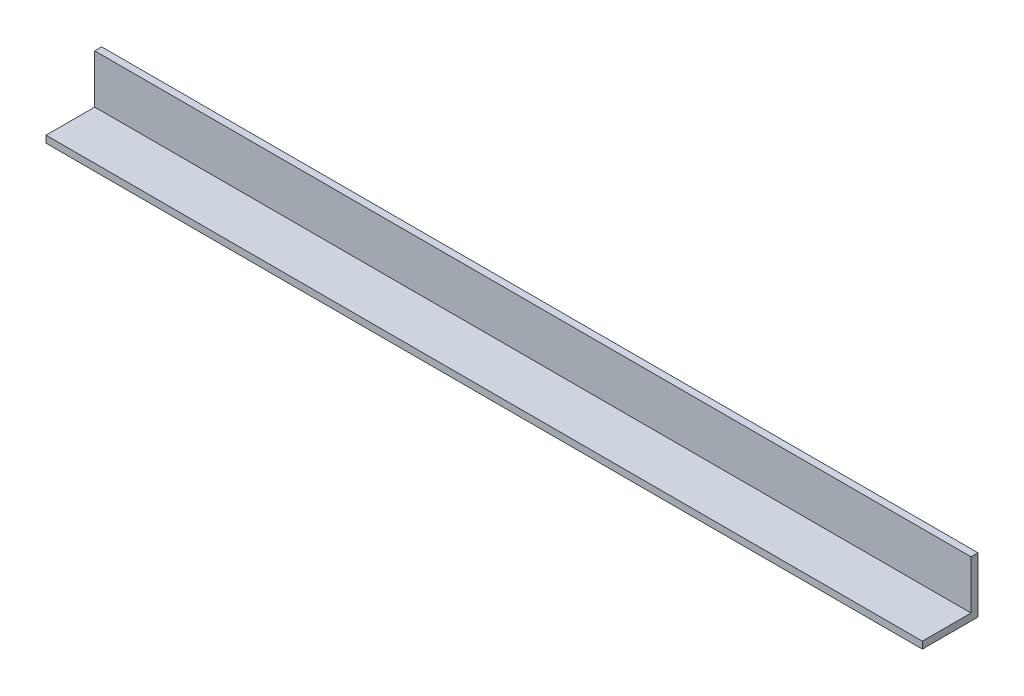
ISO-10303-21;
HEADER;
FILE_DESCRIPTION(('STEP AP214'),'2;1');
FILE_NAME('part.step','',(''),(''),'','','');
FILE_SCHEMA(('AUTOMOTIVE_DESIGN { 1 0 10303 214 1 1 1 1 }'));
ENDSEC;
DATA;
#1=APPLICATION_CONTEXT('core data for automotive mechanical design processes');
#2=APPLICATION_PROTOCOL_DEFINITION('international standard','automotive_design',2000,#1);
#3=PRODUCT_CONTEXT('',#1,'mechanical');
#4=PRODUCT('Part','Part','',(#3));
#5=PRODUCT_RELATED_PRODUCT_CATEGORY('part','',(#4));
#6=PRODUCT_DEFINITION_FORMATION('','',#4);
#7=PRODUCT_DEFINITION_CONTEXT('part definition',#1,'design');
#8=PRODUCT_DEFINITION('design','',#6,#7);
#9=PRODUCT_DEFINITION_SHAPE('','',#8);
#10=(LENGTH_UNIT() NAMED_UNIT(*) SI_UNIT(.MILLI.,.METRE.));
#11=(NAMED_UNIT(*) PLANE_ANGLE_UNIT() SI_UNIT($,.RADIAN.));
#12=(NAMED_UNIT(*) SI_UNIT($,.STERADIAN.) SOLID_ANGLE_UNIT());
#13=UNCERTAINTY_MEASURE_WITH_UNIT(LENGTH_MEASURE(1.E-05),#10,'distance_accuracy_value','');
#14=(GEOMETRIC_REPRESENTATION_CONTEXT(3) GLOBAL_UNCERTAINTY_ASSIGNED_CONTEXT((#13)) GLOBAL_UNIT_ASSIGNED_CONTEXT((#10,
#11,#12)) REPRESENTATION_CONTEXT('',''));
#15=CARTESIAN_POINT('',(0.,0.,0.));
#16=DIRECTION('',(0.,0.,1.));
#17=DIRECTION('',(1.,0.,0.));
#18=AXIS2_PLACEMENT_3D('',#15,#16,#17);
#19=CARTESIAN_POINT('',(400.,25.4,3.175));
#20=DIRECTION('',(0.,-1.,0.));
#21=DIRECTION('',(0.,0.,-1.));
#22=AXIS2_PLACEMENT_3D('',#19,#20,#21);
#23=PLANE('',#22);
#24=DIRECTION('',(0.,0.,1.));
#25=VECTOR('',#24,1.);
#26=CARTESIAN_POINT('',(0.,25.4,3.175));
#27=LINE('',#26,#25);
#28=CARTESIAN_POINT('',(0.,25.4,0.));
#29=VERTEX_POINT('',#28);
#30=CARTESIAN_POINT('',(0.,25.4,3.175));
#31=VERTEX_POINT('',#30);
#32=EDGE_CURVE('E119',#29,#31,#27,.T.);
#33=ORIENTED_EDGE('',*,*,#32,.T.);
#34=DIRECTION('',(-1.,0.,0.));
#35=VECTOR('',#34,1.);
#36=CARTESIAN_POINT('',(400.,25.4,3.175));
#37=LINE('',#36,#35);
#38=CARTESIAN_POINT('',(400.,25.4,3.175));
#39=VERTEX_POINT('',#38);
#40=EDGE_CURVE('E11',#39,#31,#37,.T.);
#41=ORIENTED_EDGE('',*,*,#40,.F.);
#42=DIRECTION('',(0.,0.,1.));
#43=VECTOR('',#42,1.);
#44=CARTESIAN_POINT('',(400.,25.4,3.175));
#45=LINE('',#44,#43);
#46=CARTESIAN_POINT('',(400.,25.4,0.));
#47=VERTEX_POINT('',#46);
#48=EDGE_CURVE('E129',#47,#39,#45,.T.);
#49=ORIENTED_EDGE('',*,*,#48,.F.);
#50=DIRECTION('',(-1.,0.,0.));
#51=VECTOR('',#50,1.);
#52=CARTESIAN_POINT('',(400.,25.4,0.));
#53=LINE('',#52,#51);
#54=EDGE_CURVE('E115',#47,#29,#53,.T.);
#55=ORIENTED_EDGE('',*,*,#54,.T.);
#56=EDGE_LOOP('',(#33,#41,#49,#55));
#57=FACE_BOUND('',#56,.T.);
#58=ADVANCED_FACE('F35',(#57),#23,.F.);
#59=CARTESIAN_POINT('',(400.,3.175,3.175));
#60=DIRECTION('',(0.,0.,-1.));
#61=DIRECTION('',(0.,1.,0.));
#62=AXIS2_PLACEMENT_3D('',#59,#60,#61);
#63=PLANE('',#62);
#64=DIRECTION('',(0.,-1.,0.));
#65=VECTOR('',#64,1.);
#66=CARTESIAN_POINT('',(0.,3.175,3.175));
#67=LINE('',#66,#65);
#68=CARTESIAN_POINT('',(0.,3.175,3.175));
#69=VERTEX_POINT('',#68);
#70=EDGE_CURVE('E122',#31,#69,#67,.T.);
#71=ORIENTED_EDGE('',*,*,#70,.T.);
#72=DIRECTION('',(-1.,0.,0.));
#73=VECTOR('',#72,1.);
#74=CARTESIAN_POINT('',(400.,3.175,3.175));
#75=LINE('',#74,#73);
#76=CARTESIAN_POINT('',(400.,3.175,3.175));
#77=VERTEX_POINT('',#76);
#78=EDGE_CURVE('E43',#77,#69,#75,.T.);
#79=ORIENTED_EDGE('',*,*,#78,.F.);
#80=DIRECTION('',(0.,-1.,0.));
#81=VECTOR('',#80,1.);
#82=CARTESIAN_POINT('',(400.,3.175,3.175));
#83=LINE('',#82,#81);
#84=EDGE_CURVE('E88',#39,#77,#83,.T.);
#85=ORIENTED_EDGE('',*,*,#84,.F.);
#86=ORIENTED_EDGE('',*,*,#40,.T.);
#87=EDGE_LOOP('',(#71,#79,#85,#86));
#88=FACE_BOUND('',#87,.T.);
#89=ADVANCED_FACE('F153',(#88),#63,.F.);
#90=CARTESIAN_POINT('',(400.,3.175,25.4));
#91=DIRECTION('',(0.,-1.,0.));
#92=DIRECTION('',(0.,0.,-1.));
#93=AXIS2_PLACEMENT_3D('',#90,#91,#92);
#94=PLANE('',#93);
#95=DIRECTION('',(0.,0.,1.));
#96=VECTOR('',#95,1.);
#97=CARTESIAN_POINT('',(0.,3.175,25.4));
#98=LINE('',#97,#96);
#99=CARTESIAN_POINT('',(0.,3.175,25.4));
#100=VERTEX_POINT('',#99);
#101=EDGE_CURVE('E124',#69,#100,#98,.T.);
#102=ORIENTED_EDGE('',*,*,#101,.T.);
#103=DIRECTION('',(-1.,0.,0.));
#104=VECTOR('',#103,1.);
#105=CARTESIAN_POINT('',(400.,3.175,25.4));
#106=LINE('',#105,#104);
#107=CARTESIAN_POINT('',(400.,3.175,25.4));
#108=VERTEX_POINT('',#107);
#109=EDGE_CURVE('E110',#108,#100,#106,.T.);
#110=ORIENTED_EDGE('',*,*,#109,.F.);
#111=DIRECTION('',(0.,0.,1.));
#112=VECTOR('',#111,1.);
#113=CARTESIAN_POINT('',(400.,3.175,25.4));
#114=LINE('',#113,#112);
#115=EDGE_CURVE('E101',#77,#108,#114,.T.);
#116=ORIENTED_EDGE('',*,*,#115,.F.);
#117=ORIENTED_EDGE('',*,*,#78,.T.);
#118=EDGE_LOOP('',(#102,#110,#116,#117));
#119=FACE_BOUND('',#118,.T.);
#120=ADVANCED_FACE('F135',(#119),#94,.F.);
#121=CARTESIAN_POINT('',(400.,0.,25.4));
#122=DIRECTION('',(0.,0.,-1.));
#123=DIRECTION('',(-1.,0.,0.));
#124=AXIS2_PLACEMENT_3D('',#121,#122,#123);
#125=PLANE('',#124);
#126=DIRECTION('',(0.,-1.,0.));
#127=VECTOR('',#126,1.);
#128=CARTESIAN_POINT('',(0.,0.,25.4));
#129=LINE('',#128,#127);
#130=CARTESIAN_POINT('',(0.,0.,25.4));
#131=VERTEX_POINT('',#130);
#132=EDGE_CURVE('E109',#100,#131,#129,.T.);
#133=ORIENTED_EDGE('',*,*,#132,.T.);
#134=DIRECTION('',(-1.,0.,0.));
#135=VECTOR('',#134,1.);
#136=CARTESIAN_POINT('',(400.,0.,25.4));
#137=LINE('',#136,#135);
#138=CARTESIAN_POINT('',(400.,0.,25.4));
#139=VERTEX_POINT('',#138);
#140=EDGE_CURVE('E106',#139,#131,#137,.T.);
#141=ORIENTED_EDGE('',*,*,#140,.F.);
#142=DIRECTION('',(0.,-1.,0.));
#143=VECTOR('',#142,1.);
#144=CARTESIAN_POINT('',(400.,0.,25.4));
#145=LINE('',#144,#143);
#146=EDGE_CURVE('E95',#108,#139,#145,.T.);
#147=ORIENTED_EDGE('',*,*,#146,.F.);
#148=ORIENTED_EDGE('',*,*,#109,.T.);
#149=EDGE_LOOP('',(#133,#141,#147,#148));
#150=FACE_BOUND('',#149,.T.);
#151=ADVANCED_FACE('F107',(#150),#125,.F.);
#152=CARTESIAN_POINT('',(400.,0.,0.));
#153=DIRECTION('',(0.,1.,0.));
#154=DIRECTION('',(0.,0.,1.));
#155=AXIS2_PLACEMENT_3D('',#152,#153,#154);
#156=PLANE('',#155);
#157=DIRECTION('',(0.,0.,-1.));
#158=VECTOR('',#157,1.);
#159=CARTESIAN_POINT('',(0.,0.,0.));
#160=LINE('',#159,#158);
#161=CARTESIAN_POINT('',(0.,0.,0.));
#162=VERTEX_POINT('',#161);
#163=EDGE_CURVE('E74',#131,#162,#160,.T.);
#164=ORIENTED_EDGE('',*,*,#163,.T.);
#165=DIRECTION('',(-1.,0.,0.));
#166=VECTOR('',#165,1.);
#167=CARTESIAN_POINT('',(400.,0.,0.));
#168=LINE('',#167,#166);
#169=CARTESIAN_POINT('',(400.,0.,0.));
#170=VERTEX_POINT('',#169);
#171=EDGE_CURVE('E111',#170,#162,#168,.T.);
#172=ORIENTED_EDGE('',*,*,#171,.F.);
#173=DIRECTION('',(0.,0.,-1.));
#174=VECTOR('',#173,1.);
#175=CARTESIAN_POINT('',(400.,0.,0.));
#176=LINE('',#175,#174);
#177=EDGE_CURVE('E99',#139,#170,#176,.T.);
#178=ORIENTED_EDGE('',*,*,#177,.F.);
#179=ORIENTED_EDGE('',*,*,#140,.T.);
#180=EDGE_LOOP('',(#164,#172,#178,#179));
#181=FACE_BOUND('',#180,.T.);
#182=ADVANCED_FACE('F113',(#181),#156,.F.);
#183=CARTESIAN_POINT('',(400.,25.4,0.));
#184=DIRECTION('',(0.,0.,1.));
#185=DIRECTION('',(1.,0.,0.));
#186=AXIS2_PLACEMENT_3D('',#183,#184,#185);
#187=PLANE('',#186);
#188=DIRECTION('',(0.,1.,0.));
#189=VECTOR('',#188,1.);
#190=CARTESIAN_POINT('',(0.,25.4,0.));
#191=LINE('',#190,#189);
#192=EDGE_CURVE('E80',#162,#29,#191,.T.);
#193=ORIENTED_EDGE('',*,*,#192,.T.);
#194=ORIENTED_EDGE('',*,*,#54,.F.);
#195=DIRECTION('',(0.,1.,0.));
#196=VECTOR('',#195,1.);
#197=CARTESIAN_POINT('',(400.,25.4,0.));
#198=LINE('',#197,#196);
#199=EDGE_CURVE('E51',#170,#47,#198,.T.);
#200=ORIENTED_EDGE('',*,*,#199,.F.);
#201=ORIENTED_EDGE('',*,*,#171,.T.);
#202=EDGE_LOOP('',(#193,#194,#200,#201));
#203=FACE_BOUND('',#202,.T.);
#204=ADVANCED_FACE('F142',(#203),#187,.F.);
#205=CARTESIAN_POINT('',(400.,0.,0.));
#206=DIRECTION('',(-1.,0.,0.));
#207=DIRECTION('',(0.,0.,1.));
#208=AXIS2_PLACEMENT_3D('',#205,#206,#207);
#209=PLANE('',#208);
#210=ORIENTED_EDGE('',*,*,#48,.T.);
#211=ORIENTED_EDGE('',*,*,#84,.T.);
#212=ORIENTED_EDGE('',*,*,#115,.T.);
#213=ORIENTED_EDGE('',*,*,#146,.T.);
#214=ORIENTED_EDGE('',*,*,#177,.T.);
#215=ORIENTED_EDGE('',*,*,#199,.T.);
#216=EDGE_LOOP('',(#210,#211,#212,#213,#214,#215));
#217=FACE_BOUND('',#216,.T.);
#218=ADVANCED_FACE('F97',(#217),#209,.F.);
#219=CARTESIAN_POINT('',(0.,0.,0.));
#220=DIRECTION('',(-1.,0.,0.));
#221=DIRECTION('',(0.,0.,1.));
#222=AXIS2_PLACEMENT_3D('',#219,#220,#221);
#223=PLANE('',#222);
#224=ORIENTED_EDGE('',*,*,#32,.F.);
#225=ORIENTED_EDGE('',*,*,#192,.F.);
#226=ORIENTED_EDGE('',*,*,#163,.F.);
#227=ORIENTED_EDGE('',*,*,#132,.F.);
#228=ORIENTED_EDGE('',*,*,#101,.F.);
#229=ORIENTED_EDGE('',*,*,#70,.F.);
#230=EDGE_LOOP('',(#224,#225,#226,#227,#228,#229));
#231=FACE_BOUND('',#230,.T.);
#232=ADVANCED_FACE('F138',(#231),#223,.T.);
#233=CLOSED_SHELL('',(#58,#89,#120,#151,#182,#204,#218,#232));
#234=MANIFOLD_SOLID_BREP('B2',#233);
#235=ADVANCED_BREP_SHAPE_REPRESENTATION('',(#18,#234),#14);
#236=SHAPE_DEFINITION_REPRESENTATION(#9,#235);
ENDSEC;
END-ISO-10303-21;
